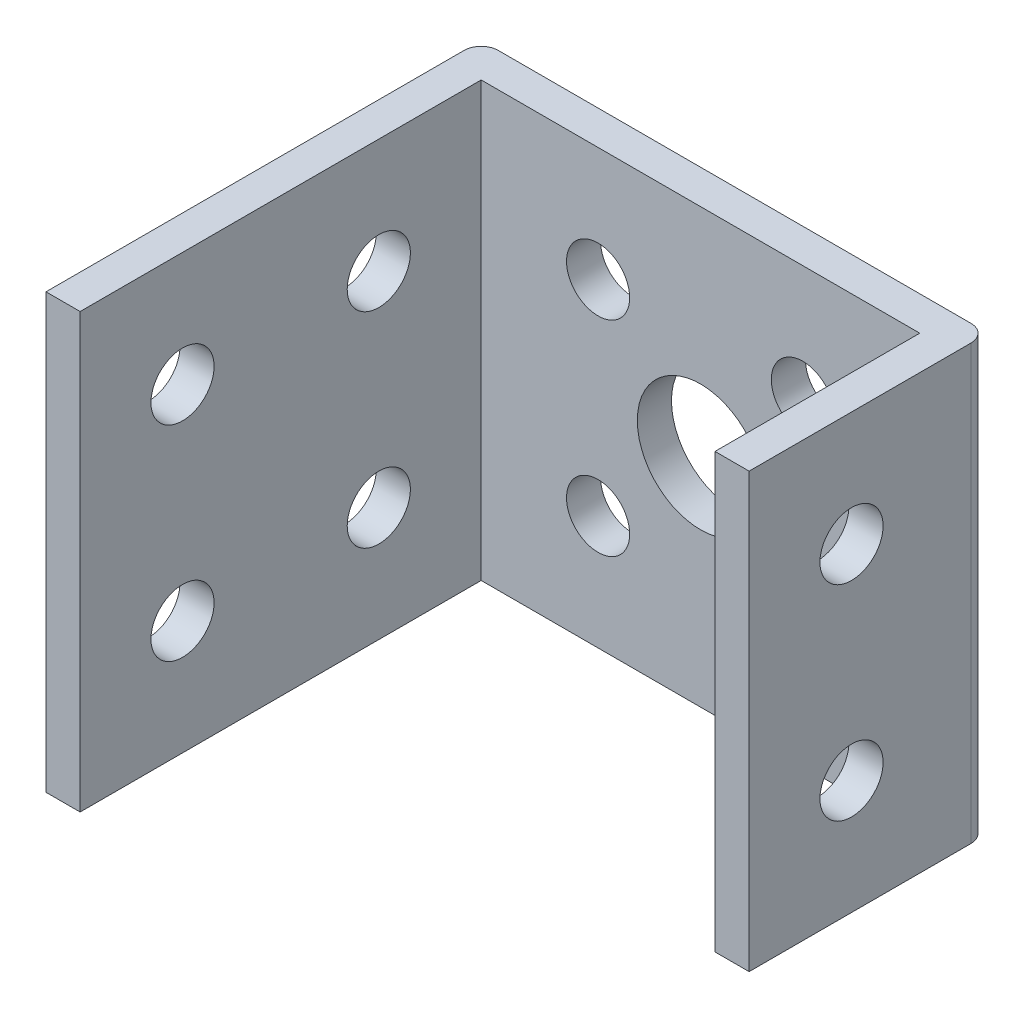
ISO-10303-21;
HEADER;
FILE_DESCRIPTION(('STEP AP214'),'2;1');
FILE_NAME('part.step','',(''),(''),'','','');
FILE_SCHEMA(('AUTOMOTIVE_DESIGN { 1 0 10303 214 1 1 1 1 }'));
ENDSEC;
DATA;
#1=APPLICATION_CONTEXT('core data for automotive mechanical design processes');
#2=APPLICATION_PROTOCOL_DEFINITION('international standard','automotive_design',2000,#1);
#3=PRODUCT_CONTEXT('',#1,'mechanical');
#4=PRODUCT('Part','Part','',(#3));
#5=PRODUCT_RELATED_PRODUCT_CATEGORY('part','',(#4));
#6=PRODUCT_DEFINITION_FORMATION('','',#4);
#7=PRODUCT_DEFINITION_CONTEXT('part definition',#1,'design');
#8=PRODUCT_DEFINITION('design','',#6,#7);
#9=PRODUCT_DEFINITION_SHAPE('','',#8);
#10=(LENGTH_UNIT() NAMED_UNIT(*) SI_UNIT(.MILLI.,.METRE.));
#11=(NAMED_UNIT(*) PLANE_ANGLE_UNIT() SI_UNIT($,.RADIAN.));
#12=(NAMED_UNIT(*) SI_UNIT($,.STERADIAN.) SOLID_ANGLE_UNIT());
#13=UNCERTAINTY_MEASURE_WITH_UNIT(LENGTH_MEASURE(1.E-05),#10,'distance_accuracy_value','');
#14=(GEOMETRIC_REPRESENTATION_CONTEXT(3) GLOBAL_UNCERTAINTY_ASSIGNED_CONTEXT((#13)) GLOBAL_UNIT_ASSIGNED_CONTEXT((#10,
#11,#12)) REPRESENTATION_CONTEXT('',''));
#15=CARTESIAN_POINT('',(0.,0.,0.));
#16=DIRECTION('',(0.,0.,1.));
#17=DIRECTION('',(1.,0.,0.));
#18=AXIS2_PLACEMENT_3D('',#15,#16,#17);
#19=CARTESIAN_POINT('',(-14.85,12.7,14.));
#20=DIRECTION('',(1.,0.,0.));
#21=DIRECTION('',(0.,0.,-1.));
#22=AXIS2_PLACEMENT_3D('',#19,#20,#21);
#23=PLANE('',#22);
#24=CARTESIAN_POINT('',(-14.85,6.,8.));
#25=DIRECTION('',(-1.,0.,0.));
#26=DIRECTION('',(0.,0.,1.));
#27=AXIS2_PLACEMENT_3D('',#24,#25,#26);
#28=CIRCLE('',#27,1.85);
#29=CARTESIAN_POINT('',(-14.85,6.,9.85));
#30=VERTEX_POINT('',#29);
#31=EDGE_CURVE('E179',#30,#30,#28,.T.);
#32=ORIENTED_EDGE('',*,*,#31,.F.);
#33=EDGE_LOOP('',(#32));
#34=FACE_BOUND('',#33,.T.);
#35=CARTESIAN_POINT('',(-14.85,-6.,8.));
#36=DIRECTION('',(-1.,0.,0.));
#37=DIRECTION('',(0.,0.,1.));
#38=AXIS2_PLACEMENT_3D('',#35,#36,#37);
#39=CIRCLE('',#38,1.85);
#40=CARTESIAN_POINT('',(-14.85,-6.,9.85));
#41=VERTEX_POINT('',#40);
#42=EDGE_CURVE('E191',#41,#41,#39,.T.);
#43=ORIENTED_EDGE('',*,*,#42,.F.);
#44=EDGE_LOOP('',(#43));
#45=FACE_BOUND('',#44,.T.);
#46=DIRECTION('',(0.,0.,1.));
#47=VECTOR('',#46,1.);
#48=CARTESIAN_POINT('',(-14.85,12.7,14.));
#49=LINE('',#48,#47);
#50=CARTESIAN_POINT('',(-14.85,12.7,0.999999999999999));
#51=VERTEX_POINT('',#50);
#52=CARTESIAN_POINT('',(-14.85,12.7,25.5));
#53=VERTEX_POINT('',#52);
#54=EDGE_CURVE('E123',#51,#53,#49,.T.);
#55=ORIENTED_EDGE('',*,*,#54,.F.);
#56=DIRECTION('',(0.,-1.,0.));
#57=VECTOR('',#56,1.);
#58=CARTESIAN_POINT('',(-14.85,12.7,0.999999999999999));
#59=LINE('',#58,#57);
#60=CARTESIAN_POINT('',(-14.85,-12.7,0.999999999999999));
#61=VERTEX_POINT('',#60);
#62=EDGE_CURVE('E11',#51,#61,#59,.T.);
#63=ORIENTED_EDGE('',*,*,#62,.T.);
#64=DIRECTION('',(0.,0.,1.));
#65=VECTOR('',#64,1.);
#66=CARTESIAN_POINT('',(-14.85,-12.7,14.));
#67=LINE('',#66,#65);
#68=CARTESIAN_POINT('',(-14.85,-12.7,25.5));
#69=VERTEX_POINT('',#68);
#70=EDGE_CURVE('E203',#61,#69,#67,.T.);
#71=ORIENTED_EDGE('',*,*,#70,.T.);
#72=DIRECTION('',(0.,-1.,0.));
#73=VECTOR('',#72,1.);
#74=CARTESIAN_POINT('',(-14.85,12.7,25.5));
#75=LINE('',#74,#73);
#76=EDGE_CURVE('E131',#53,#69,#75,.T.);
#77=ORIENTED_EDGE('',*,*,#76,.F.);
#78=EDGE_LOOP('',(#55,#63,#71,#77));
#79=FACE_BOUND('',#78,.T.);
#80=CARTESIAN_POINT('',(-14.85,6.,19.5));
#81=DIRECTION('',(1.,0.,0.));
#82=DIRECTION('',(0.,0.,-1.));
#83=AXIS2_PLACEMENT_3D('',#80,#81,#82);
#84=CIRCLE('',#83,1.85);
#85=CARTESIAN_POINT('',(-14.85,6.,17.65));
#86=VERTEX_POINT('',#85);
#87=EDGE_CURVE('E139',#86,#86,#84,.T.);
#88=ORIENTED_EDGE('',*,*,#87,.T.);
#89=EDGE_LOOP('',(#88));
#90=FACE_BOUND('',#89,.T.);
#91=CARTESIAN_POINT('',(-14.85,-6.,19.5));
#92=DIRECTION('',(1.,0.,0.));
#93=DIRECTION('',(0.,0.,-1.));
#94=AXIS2_PLACEMENT_3D('',#91,#92,#93);
#95=CIRCLE('',#94,1.85);
#96=CARTESIAN_POINT('',(-14.85,-6.,17.65));
#97=VERTEX_POINT('',#96);
#98=EDGE_CURVE('E136',#97,#97,#95,.T.);
#99=ORIENTED_EDGE('',*,*,#98,.T.);
#100=EDGE_LOOP('',(#99));
#101=FACE_BOUND('',#100,.T.);
#102=ADVANCED_FACE('F32',(#34,#45,#79,#90,#101),#23,.F.);
#103=CARTESIAN_POINT('',(-12.85,12.7,2.));
#104=DIRECTION('',(-1.,0.,0.));
#105=DIRECTION('',(0.,0.,1.));
#106=AXIS2_PLACEMENT_3D('',#103,#104,#105);
#107=PLANE('',#106);
#108=CARTESIAN_POINT('',(-12.85,6.,8.));
#109=DIRECTION('',(-1.,0.,0.));
#110=DIRECTION('',(0.,0.,1.));
#111=AXIS2_PLACEMENT_3D('',#108,#109,#110);
#112=CIRCLE('',#111,1.85);
#113=CARTESIAN_POINT('',(-12.85,6.,9.85));
#114=VERTEX_POINT('',#113);
#115=EDGE_CURVE('E188',#114,#114,#112,.T.);
#116=ORIENTED_EDGE('',*,*,#115,.T.);
#117=EDGE_LOOP('',(#116));
#118=FACE_BOUND('',#117,.T.);
#119=CARTESIAN_POINT('',(-12.85,-6.,8.));
#120=DIRECTION('',(-1.,0.,0.));
#121=DIRECTION('',(0.,0.,1.));
#122=AXIS2_PLACEMENT_3D('',#119,#120,#121);
#123=CIRCLE('',#122,1.85);
#124=CARTESIAN_POINT('',(-12.85,-6.,9.85));
#125=VERTEX_POINT('',#124);
#126=EDGE_CURVE('E200',#125,#125,#123,.T.);
#127=ORIENTED_EDGE('',*,*,#126,.T.);
#128=EDGE_LOOP('',(#127));
#129=FACE_BOUND('',#128,.T.);
#130=DIRECTION('',(0.,0.,-1.));
#131=VECTOR('',#130,1.);
#132=CARTESIAN_POINT('',(-12.85,-12.7,2.));
#133=LINE('',#132,#131);
#134=CARTESIAN_POINT('',(-12.85,-12.7,25.5));
#135=VERTEX_POINT('',#134);
#136=CARTESIAN_POINT('',(-12.85,-12.7,2.));
#137=VERTEX_POINT('',#136);
#138=EDGE_CURVE('E217',#135,#137,#133,.T.);
#139=ORIENTED_EDGE('',*,*,#138,.T.);
#140=DIRECTION('',(0.,-1.,0.));
#141=VECTOR('',#140,1.);
#142=CARTESIAN_POINT('',(-12.85,12.7,2.));
#143=LINE('',#142,#141);
#144=CARTESIAN_POINT('',(-12.85,12.7,2.));
#145=VERTEX_POINT('',#144);
#146=EDGE_CURVE('E120',#145,#137,#143,.T.);
#147=ORIENTED_EDGE('',*,*,#146,.F.);
#148=DIRECTION('',(0.,0.,-1.));
#149=VECTOR('',#148,1.);
#150=CARTESIAN_POINT('',(-12.85,12.7,2.));
#151=LINE('',#150,#149);
#152=CARTESIAN_POINT('',(-12.85,12.7,25.5));
#153=VERTEX_POINT('',#152);
#154=EDGE_CURVE('E112',#153,#145,#151,.T.);
#155=ORIENTED_EDGE('',*,*,#154,.F.);
#156=DIRECTION('',(0.,1.,0.));
#157=VECTOR('',#156,1.);
#158=CARTESIAN_POINT('',(-12.85,12.7,25.5));
#159=LINE('',#158,#157);
#160=EDGE_CURVE('E117',#135,#153,#159,.T.);
#161=ORIENTED_EDGE('',*,*,#160,.F.);
#162=EDGE_LOOP('',(#139,#147,#155,#161));
#163=FACE_BOUND('',#162,.T.);
#164=CARTESIAN_POINT('',(-12.85,-6.,19.5));
#165=DIRECTION('',(-1.,0.,0.));
#166=DIRECTION('',(0.,0.,1.));
#167=AXIS2_PLACEMENT_3D('',#164,#165,#166);
#168=CIRCLE('',#167,1.85);
#169=CARTESIAN_POINT('',(-12.85,-6.,21.35));
#170=VERTEX_POINT('',#169);
#171=EDGE_CURVE('E147',#170,#170,#168,.T.);
#172=ORIENTED_EDGE('',*,*,#171,.T.);
#173=EDGE_LOOP('',(#172));
#174=FACE_BOUND('',#173,.T.);
#175=CARTESIAN_POINT('',(-12.85,6.,19.5));
#176=DIRECTION('',(-1.,0.,0.));
#177=DIRECTION('',(0.,0.,1.));
#178=AXIS2_PLACEMENT_3D('',#175,#176,#177);
#179=CIRCLE('',#178,1.85);
#180=CARTESIAN_POINT('',(-12.85,6.,21.35));
#181=VERTEX_POINT('',#180);
#182=EDGE_CURVE('E143',#181,#181,#179,.T.);
#183=ORIENTED_EDGE('',*,*,#182,.T.);
#184=EDGE_LOOP('',(#183));
#185=FACE_BOUND('',#184,.T.);
#186=ADVANCED_FACE('F114',(#118,#129,#163,#174,#185),#107,.F.);
#187=CARTESIAN_POINT('',(12.85,12.7,2.00000000000002));
#188=DIRECTION('',(0.,0.,-1.));
#189=DIRECTION('',(-1.,0.,0.));
#190=AXIS2_PLACEMENT_3D('',#187,#188,#189);
#191=PLANE('',#190);
#192=CARTESIAN_POINT('',(6.,6.,2.00000000000001));
#193=DIRECTION('',(0.,0.,1.));
#194=DIRECTION('',(1.,0.,0.));
#195=AXIS2_PLACEMENT_3D('',#192,#193,#194);
#196=CIRCLE('',#195,1.85);
#197=CARTESIAN_POINT('',(7.85,6.,2.00000000000001));
#198=VERTEX_POINT('',#197);
#199=EDGE_CURVE('E146',#198,#198,#196,.T.);
#200=ORIENTED_EDGE('',*,*,#199,.F.);
#201=EDGE_LOOP('',(#200));
#202=FACE_BOUND('',#201,.T.);
#203=CARTESIAN_POINT('',(6.,-6.,2.00000000000001));
#204=DIRECTION('',(0.,0.,1.));
#205=DIRECTION('',(1.,0.,0.));
#206=AXIS2_PLACEMENT_3D('',#203,#204,#205);
#207=CIRCLE('',#206,1.85);
#208=CARTESIAN_POINT('',(7.85,-6.,2.00000000000001));
#209=VERTEX_POINT('',#208);
#210=EDGE_CURVE('E153',#209,#209,#207,.T.);
#211=ORIENTED_EDGE('',*,*,#210,.F.);
#212=EDGE_LOOP('',(#211));
#213=FACE_BOUND('',#212,.T.);
#214=CARTESIAN_POINT('',(-6.,-6.,2.00000000000001));
#215=DIRECTION('',(0.,0.,1.));
#216=DIRECTION('',(1.,0.,0.));
#217=AXIS2_PLACEMENT_3D('',#214,#215,#216);
#218=CIRCLE('',#217,1.85);
#219=CARTESIAN_POINT('',(-4.15,-6.,2.00000000000001));
#220=VERTEX_POINT('',#219);
#221=EDGE_CURVE('E159',#220,#220,#218,.T.);
#222=ORIENTED_EDGE('',*,*,#221,.F.);
#223=EDGE_LOOP('',(#222));
#224=FACE_BOUND('',#223,.T.);
#225=CARTESIAN_POINT('',(-6.,6.,2.00000000000001));
#226=DIRECTION('',(0.,0.,1.));
#227=DIRECTION('',(1.,0.,0.));
#228=AXIS2_PLACEMENT_3D('',#225,#226,#227);
#229=CIRCLE('',#228,1.85);
#230=CARTESIAN_POINT('',(-4.15,6.,2.00000000000001));
#231=VERTEX_POINT('',#230);
#232=EDGE_CURVE('E165',#231,#231,#229,.T.);
#233=ORIENTED_EDGE('',*,*,#232,.F.);
#234=EDGE_LOOP('',(#233));
#235=FACE_BOUND('',#234,.T.);
#236=CARTESIAN_POINT('',(0.,0.,2.00000000000001));
#237=DIRECTION('',(0.,0.,-1.));
#238=DIRECTION('',(-1.,0.,0.));
#239=AXIS2_PLACEMENT_3D('',#236,#237,#238);
#240=CIRCLE('',#239,3.7);
#241=CARTESIAN_POINT('',(-3.7,0.,2.00000000000001));
#242=VERTEX_POINT('',#241);
#243=EDGE_CURVE('E176',#242,#242,#240,.T.);
#244=ORIENTED_EDGE('',*,*,#243,.T.);
#245=EDGE_LOOP('',(#244));
#246=FACE_BOUND('',#245,.T.);
#247=DIRECTION('',(1.,0.,0.));
#248=VECTOR('',#247,1.);
#249=CARTESIAN_POINT('',(12.85,-12.7,2.00000000000002));
#250=LINE('',#249,#248);
#251=CARTESIAN_POINT('',(12.85,-12.7,2.00000000000002));
#252=VERTEX_POINT('',#251);
#253=EDGE_CURVE('E219',#137,#252,#250,.T.);
#254=ORIENTED_EDGE('',*,*,#253,.T.);
#255=DIRECTION('',(0.,-1.,0.));
#256=VECTOR('',#255,1.);
#257=CARTESIAN_POINT('',(12.85,12.7,2.00000000000002));
#258=LINE('',#257,#256);
#259=CARTESIAN_POINT('',(12.85,12.7,2.00000000000002));
#260=VERTEX_POINT('',#259);
#261=EDGE_CURVE('E234',#260,#252,#258,.T.);
#262=ORIENTED_EDGE('',*,*,#261,.F.);
#263=DIRECTION('',(1.,0.,0.));
#264=VECTOR('',#263,1.);
#265=CARTESIAN_POINT('',(12.85,12.7,2.00000000000002));
#266=LINE('',#265,#264);
#267=EDGE_CURVE('E122',#145,#260,#266,.T.);
#268=ORIENTED_EDGE('',*,*,#267,.F.);
#269=ORIENTED_EDGE('',*,*,#146,.T.);
#270=EDGE_LOOP('',(#254,#262,#268,#269));
#271=FACE_BOUND('',#270,.T.);
#272=ADVANCED_FACE('F274',(#202,#213,#224,#235,#246,#271),#191,.F.);
#273=CARTESIAN_POINT('',(12.85,12.7,14.));
#274=DIRECTION('',(1.,0.,0.));
#275=DIRECTION('',(0.,0.,-1.));
#276=AXIS2_PLACEMENT_3D('',#273,#274,#275);
#277=PLANE('',#276);
#278=CARTESIAN_POINT('',(12.85,6.,8.));
#279=DIRECTION('',(1.,0.,0.));
#280=DIRECTION('',(0.,0.,-1.));
#281=AXIS2_PLACEMENT_3D('',#278,#279,#280);
#282=CIRCLE('',#281,1.85);
#283=CARTESIAN_POINT('',(12.85,6.,6.15));
#284=VERTEX_POINT('',#283);
#285=EDGE_CURVE('E183',#284,#284,#282,.T.);
#286=ORIENTED_EDGE('',*,*,#285,.T.);
#287=EDGE_LOOP('',(#286));
#288=FACE_BOUND('',#287,.T.);
#289=CARTESIAN_POINT('',(12.85,-6.,8.));
#290=DIRECTION('',(1.,0.,0.));
#291=DIRECTION('',(0.,0.,-1.));
#292=AXIS2_PLACEMENT_3D('',#289,#290,#291);
#293=CIRCLE('',#292,1.85);
#294=CARTESIAN_POINT('',(12.85,-6.,6.15));
#295=VERTEX_POINT('',#294);
#296=EDGE_CURVE('E195',#295,#295,#293,.T.);
#297=ORIENTED_EDGE('',*,*,#296,.T.);
#298=EDGE_LOOP('',(#297));
#299=FACE_BOUND('',#298,.T.);
#300=DIRECTION('',(0.,0.,1.));
#301=VECTOR('',#300,1.);
#302=CARTESIAN_POINT('',(12.85,-12.7,14.));
#303=LINE('',#302,#301);
#304=CARTESIAN_POINT('',(12.85,-12.7,14.));
#305=VERTEX_POINT('',#304);
#306=EDGE_CURVE('E221',#252,#305,#303,.T.);
#307=ORIENTED_EDGE('',*,*,#306,.T.);
#308=DIRECTION('',(0.,-1.,0.));
#309=VECTOR('',#308,1.);
#310=CARTESIAN_POINT('',(12.85,12.7,14.));
#311=LINE('',#310,#309);
#312=CARTESIAN_POINT('',(12.85,12.7,14.));
#313=VERTEX_POINT('',#312);
#314=EDGE_CURVE('E231',#313,#305,#311,.T.);
#315=ORIENTED_EDGE('',*,*,#314,.F.);
#316=DIRECTION('',(0.,0.,1.));
#317=VECTOR('',#316,1.);
#318=CARTESIAN_POINT('',(12.85,12.7,14.));
#319=LINE('',#318,#317);
#320=EDGE_CURVE('E207',#260,#313,#319,.T.);
#321=ORIENTED_EDGE('',*,*,#320,.F.);
#322=ORIENTED_EDGE('',*,*,#261,.T.);
#323=EDGE_LOOP('',(#307,#315,#321,#322));
#324=FACE_BOUND('',#323,.T.);
#325=ADVANCED_FACE('F270',(#288,#299,#324),#277,.F.);
#326=CARTESIAN_POINT('',(14.85,12.7,14.));
#327=DIRECTION('',(0.,0.,-1.));
#328=DIRECTION('',(-1.,0.,0.));
#329=AXIS2_PLACEMENT_3D('',#326,#327,#328);
#330=PLANE('',#329);
#331=DIRECTION('',(1.,0.,0.));
#332=VECTOR('',#331,1.);
#333=CARTESIAN_POINT('',(14.85,-12.7,14.));
#334=LINE('',#333,#332);
#335=CARTESIAN_POINT('',(14.85,-12.7,14.));
#336=VERTEX_POINT('',#335);
#337=EDGE_CURVE('E223',#305,#336,#334,.T.);
#338=ORIENTED_EDGE('',*,*,#337,.T.);
#339=DIRECTION('',(0.,-1.,0.));
#340=VECTOR('',#339,1.);
#341=CARTESIAN_POINT('',(14.85,12.7,14.));
#342=LINE('',#341,#340);
#343=CARTESIAN_POINT('',(14.85,12.7,14.));
#344=VERTEX_POINT('',#343);
#345=EDGE_CURVE('E215',#344,#336,#342,.T.);
#346=ORIENTED_EDGE('',*,*,#345,.F.);
#347=DIRECTION('',(1.,0.,0.));
#348=VECTOR('',#347,1.);
#349=CARTESIAN_POINT('',(14.85,12.7,14.));
#350=LINE('',#349,#348);
#351=EDGE_CURVE('E209',#313,#344,#350,.T.);
#352=ORIENTED_EDGE('',*,*,#351,.F.);
#353=ORIENTED_EDGE('',*,*,#314,.T.);
#354=EDGE_LOOP('',(#338,#346,#352,#353));
#355=FACE_BOUND('',#354,.T.);
#356=ADVANCED_FACE('F265',(#355),#330,.F.);
#357=CARTESIAN_POINT('',(14.85,12.7,0.));
#358=DIRECTION('',(-1.,0.,0.));
#359=DIRECTION('',(0.,0.,1.));
#360=AXIS2_PLACEMENT_3D('',#357,#358,#359);
#361=PLANE('',#360);
#362=CARTESIAN_POINT('',(14.85,6.,8.));
#363=DIRECTION('',(-1.,0.,0.));
#364=DIRECTION('',(0.,0.,1.));
#365=AXIS2_PLACEMENT_3D('',#362,#363,#364);
#366=CIRCLE('',#365,1.85);
#367=CARTESIAN_POINT('',(14.85,6.,9.85));
#368=VERTEX_POINT('',#367);
#369=EDGE_CURVE('E180',#368,#368,#366,.T.);
#370=ORIENTED_EDGE('',*,*,#369,.T.);
#371=EDGE_LOOP('',(#370));
#372=FACE_BOUND('',#371,.T.);
#373=CARTESIAN_POINT('',(14.85,-6.,8.));
#374=DIRECTION('',(-1.,0.,0.));
#375=DIRECTION('',(0.,0.,1.));
#376=AXIS2_PLACEMENT_3D('',#373,#374,#375);
#377=CIRCLE('',#376,1.85);
#378=CARTESIAN_POINT('',(14.85,-6.,9.85));
#379=VERTEX_POINT('',#378);
#380=EDGE_CURVE('E192',#379,#379,#377,.T.);
#381=ORIENTED_EDGE('',*,*,#380,.T.);
#382=EDGE_LOOP('',(#381));
#383=FACE_BOUND('',#382,.T.);
#384=DIRECTION('',(0.,0.,-1.));
#385=VECTOR('',#384,1.);
#386=CARTESIAN_POINT('',(14.85,-12.7,0.));
#387=LINE('',#386,#385);
#388=CARTESIAN_POINT('',(14.85,-12.7,1.));
#389=VERTEX_POINT('',#388);
#390=EDGE_CURVE('E225',#336,#389,#387,.T.);
#391=ORIENTED_EDGE('',*,*,#390,.T.);
#392=DIRECTION('',(0.,-1.,0.));
#393=VECTOR('',#392,1.);
#394=CARTESIAN_POINT('',(14.85,12.7,1.));
#395=LINE('',#394,#393);
#396=CARTESIAN_POINT('',(14.85,12.7,1.));
#397=VERTEX_POINT('',#396);
#398=EDGE_CURVE('E55',#389,#397,#395,.F.);
#399=ORIENTED_EDGE('',*,*,#398,.T.);
#400=DIRECTION('',(0.,0.,-1.));
#401=VECTOR('',#400,1.);
#402=CARTESIAN_POINT('',(14.85,12.7,0.));
#403=LINE('',#402,#401);
#404=EDGE_CURVE('E211',#344,#397,#403,.T.);
#405=ORIENTED_EDGE('',*,*,#404,.F.);
#406=ORIENTED_EDGE('',*,*,#345,.T.);
#407=EDGE_LOOP('',(#391,#399,#405,#406));
#408=FACE_BOUND('',#407,.T.);
#409=ADVANCED_FACE('F261',(#372,#383,#408),#361,.F.);
#410=CARTESIAN_POINT('',(-14.85,12.7,0.));
#411=DIRECTION('',(0.,0.,1.));
#412=DIRECTION('',(1.,0.,0.));
#413=AXIS2_PLACEMENT_3D('',#410,#411,#412);
#414=PLANE('',#413);
#415=CARTESIAN_POINT('',(6.,6.,0.));
#416=DIRECTION('',(0.,0.,1.));
#417=DIRECTION('',(1.,0.,0.));
#418=AXIS2_PLACEMENT_3D('',#415,#416,#417);
#419=CIRCLE('',#418,1.85);
#420=CARTESIAN_POINT('',(7.85,6.,0.));
#421=VERTEX_POINT('',#420);
#422=EDGE_CURVE('E150',#421,#421,#419,.T.);
#423=ORIENTED_EDGE('',*,*,#422,.T.);
#424=EDGE_LOOP('',(#423));
#425=FACE_BOUND('',#424,.T.);
#426=CARTESIAN_POINT('',(6.,-6.,0.));
#427=DIRECTION('',(0.,0.,1.));
#428=DIRECTION('',(1.,0.,0.));
#429=AXIS2_PLACEMENT_3D('',#426,#427,#428);
#430=CIRCLE('',#429,1.85);
#431=CARTESIAN_POINT('',(7.85,-6.,0.));
#432=VERTEX_POINT('',#431);
#433=EDGE_CURVE('E156',#432,#432,#430,.T.);
#434=ORIENTED_EDGE('',*,*,#433,.T.);
#435=EDGE_LOOP('',(#434));
#436=FACE_BOUND('',#435,.T.);
#437=CARTESIAN_POINT('',(-6.,-6.,0.));
#438=DIRECTION('',(0.,0.,1.));
#439=DIRECTION('',(1.,0.,0.));
#440=AXIS2_PLACEMENT_3D('',#437,#438,#439);
#441=CIRCLE('',#440,1.85);
#442=CARTESIAN_POINT('',(-4.15,-6.,0.));
#443=VERTEX_POINT('',#442);
#444=EDGE_CURVE('E162',#443,#443,#441,.T.);
#445=ORIENTED_EDGE('',*,*,#444,.T.);
#446=EDGE_LOOP('',(#445));
#447=FACE_BOUND('',#446,.T.);
#448=CARTESIAN_POINT('',(-6.,6.,0.));
#449=DIRECTION('',(0.,0.,1.));
#450=DIRECTION('',(1.,0.,0.));
#451=AXIS2_PLACEMENT_3D('',#448,#449,#450);
#452=CIRCLE('',#451,1.85);
#453=CARTESIAN_POINT('',(-4.15,6.,0.));
#454=VERTEX_POINT('',#453);
#455=EDGE_CURVE('E168',#454,#454,#452,.T.);
#456=ORIENTED_EDGE('',*,*,#455,.T.);
#457=EDGE_LOOP('',(#456));
#458=FACE_BOUND('',#457,.T.);
#459=CARTESIAN_POINT('',(0.,0.,0.));
#460=DIRECTION('',(0.,0.,-1.));
#461=DIRECTION('',(-1.,0.,0.));
#462=AXIS2_PLACEMENT_3D('',#459,#460,#461);
#463=CIRCLE('',#462,3.7);
#464=CARTESIAN_POINT('',(-3.7,0.,0.));
#465=VERTEX_POINT('',#464);
#466=EDGE_CURVE('E171',#465,#465,#463,.T.);
#467=ORIENTED_EDGE('',*,*,#466,.F.);
#468=EDGE_LOOP('',(#467));
#469=FACE_BOUND('',#468,.T.);
#470=DIRECTION('',(-1.,0.,0.));
#471=VECTOR('',#470,1.);
#472=CARTESIAN_POINT('',(-14.85,12.7,0.));
#473=LINE('',#472,#471);
#474=CARTESIAN_POINT('',(13.85,12.7,0.));
#475=VERTEX_POINT('',#474);
#476=CARTESIAN_POINT('',(-13.85,12.7,0.));
#477=VERTEX_POINT('',#476);
#478=EDGE_CURVE('E213',#475,#477,#473,.T.);
#479=ORIENTED_EDGE('',*,*,#478,.F.);
#480=DIRECTION('',(0.,-1.,0.));
#481=VECTOR('',#480,1.);
#482=CARTESIAN_POINT('',(13.85,12.7,0.));
#483=LINE('',#482,#481);
#484=CARTESIAN_POINT('',(13.85,-12.7,0.));
#485=VERTEX_POINT('',#484);
#486=EDGE_CURVE('E240',#475,#485,#483,.T.);
#487=ORIENTED_EDGE('',*,*,#486,.T.);
#488=DIRECTION('',(-1.,0.,0.));
#489=VECTOR('',#488,1.);
#490=CARTESIAN_POINT('',(-14.85,-12.7,0.));
#491=LINE('',#490,#489);
#492=CARTESIAN_POINT('',(-13.85,-12.7,0.));
#493=VERTEX_POINT('',#492);
#494=EDGE_CURVE('E204',#485,#493,#491,.T.);
#495=ORIENTED_EDGE('',*,*,#494,.T.);
#496=DIRECTION('',(0.,-1.,0.));
#497=VECTOR('',#496,1.);
#498=CARTESIAN_POINT('',(-13.85,12.7,0.));
#499=LINE('',#498,#497);
#500=EDGE_CURVE('E238',#493,#477,#499,.F.);
#501=ORIENTED_EDGE('',*,*,#500,.T.);
#502=EDGE_LOOP('',(#479,#487,#495,#501));
#503=FACE_BOUND('',#502,.T.);
#504=ADVANCED_FACE('F253',(#425,#436,#447,#458,#469,#503),#414,.F.);
#505=CARTESIAN_POINT('',(0.,12.7,0.));
#506=DIRECTION('',(0.,-1.,0.));
#507=DIRECTION('',(0.,0.,-1.));
#508=AXIS2_PLACEMENT_3D('',#505,#506,#507);
#509=PLANE('',#508);
#510=ORIENTED_EDGE('',*,*,#404,.T.);
#511=CARTESIAN_POINT('',(13.85,12.7,1.));
#512=DIRECTION('',(0.,-1.,0.));
#513=DIRECTION('',(0.,0.,-1.));
#514=AXIS2_PLACEMENT_3D('',#511,#512,#513);
#515=CIRCLE('',#514,1.);
#516=EDGE_CURVE('E40',#397,#475,#515,.F.);
#517=ORIENTED_EDGE('',*,*,#516,.T.);
#518=ORIENTED_EDGE('',*,*,#478,.T.);
#519=CARTESIAN_POINT('',(-13.85,12.7,0.999999999999999));
#520=DIRECTION('',(0.,-1.,0.));
#521=DIRECTION('',(0.,0.,-1.));
#522=AXIS2_PLACEMENT_3D('',#519,#520,#521);
#523=CIRCLE('',#522,1.);
#524=EDGE_CURVE('E47',#477,#51,#523,.F.);
#525=ORIENTED_EDGE('',*,*,#524,.T.);
#526=ORIENTED_EDGE('',*,*,#54,.T.);
#527=DIRECTION('',(-1.,0.,0.));
#528=VECTOR('',#527,1.);
#529=CARTESIAN_POINT('',(15.0320730936564,12.7,25.5));
#530=LINE('',#529,#528);
#531=EDGE_CURVE('E126',#153,#53,#530,.T.);
#532=ORIENTED_EDGE('',*,*,#531,.F.);
#533=ORIENTED_EDGE('',*,*,#154,.T.);
#534=ORIENTED_EDGE('',*,*,#267,.T.);
#535=ORIENTED_EDGE('',*,*,#320,.T.);
#536=ORIENTED_EDGE('',*,*,#351,.T.);
#537=EDGE_LOOP('',(#510,#517,#518,#525,#526,#532,#533,#534,#535,#536));
#538=FACE_BOUND('',#537,.T.);
#539=ADVANCED_FACE('F127',(#538),#509,.F.);
#540=CARTESIAN_POINT('',(0.,-12.7,0.));
#541=DIRECTION('',(0.,-1.,0.));
#542=DIRECTION('',(0.,0.,-1.));
#543=AXIS2_PLACEMENT_3D('',#540,#541,#542);
#544=PLANE('',#543);
#545=ORIENTED_EDGE('',*,*,#494,.F.);
#546=CARTESIAN_POINT('',(13.85,-12.7,1.));
#547=DIRECTION('',(0.,-1.,0.));
#548=DIRECTION('',(0.,0.,-1.));
#549=AXIS2_PLACEMENT_3D('',#546,#547,#548);
#550=CIRCLE('',#549,1.);
#551=EDGE_CURVE('E245',#485,#389,#550,.T.);
#552=ORIENTED_EDGE('',*,*,#551,.T.);
#553=ORIENTED_EDGE('',*,*,#390,.F.);
#554=ORIENTED_EDGE('',*,*,#337,.F.);
#555=ORIENTED_EDGE('',*,*,#306,.F.);
#556=ORIENTED_EDGE('',*,*,#253,.F.);
#557=ORIENTED_EDGE('',*,*,#138,.F.);
#558=DIRECTION('',(-1.,0.,0.));
#559=VECTOR('',#558,1.);
#560=CARTESIAN_POINT('',(15.0320730936564,-12.7,25.5));
#561=LINE('',#560,#559);
#562=EDGE_CURVE('E135',#135,#69,#561,.T.);
#563=ORIENTED_EDGE('',*,*,#562,.T.);
#564=ORIENTED_EDGE('',*,*,#70,.F.);
#565=CARTESIAN_POINT('',(-13.85,-12.7,0.999999999999999));
#566=DIRECTION('',(0.,-1.,0.));
#567=DIRECTION('',(0.,0.,-1.));
#568=AXIS2_PLACEMENT_3D('',#565,#566,#567);
#569=CIRCLE('',#568,1.);
#570=EDGE_CURVE('E243',#61,#493,#569,.T.);
#571=ORIENTED_EDGE('',*,*,#570,.T.);
#572=EDGE_LOOP('',(#545,#552,#553,#554,#555,#556,#557,#563,#564,#571));
#573=FACE_BOUND('',#572,.T.);
#574=ADVANCED_FACE('F259',(#573),#544,.T.);
#575=CARTESIAN_POINT('',(14.85,-6.,8.));
#576=DIRECTION('',(-1.,0.,0.));
#577=DIRECTION('',(0.,0.,1.));
#578=AXIS2_PLACEMENT_3D('',#575,#576,#577);
#579=CYLINDRICAL_SURFACE('',#578,1.85);
#580=ORIENTED_EDGE('',*,*,#380,.F.);
#581=EDGE_LOOP('',(#580));
#582=FACE_BOUND('',#581,.T.);
#583=ORIENTED_EDGE('',*,*,#296,.F.);
#584=EDGE_LOOP('',(#583));
#585=FACE_BOUND('',#584,.T.);
#586=ADVANCED_FACE('F342',(#582,#585),#579,.F.);
#587=ORIENTED_EDGE('',*,*,#42,.T.);
#588=EDGE_LOOP('',(#587));
#589=FACE_BOUND('',#588,.T.);
#590=ORIENTED_EDGE('',*,*,#126,.F.);
#591=EDGE_LOOP('',(#590));
#592=FACE_BOUND('',#591,.T.);
#593=ADVANCED_FACE('F339',(#589,#592),#579,.F.);
#594=CARTESIAN_POINT('',(14.85,6.,8.));
#595=DIRECTION('',(-1.,0.,0.));
#596=DIRECTION('',(0.,0.,1.));
#597=AXIS2_PLACEMENT_3D('',#594,#595,#596);
#598=CYLINDRICAL_SURFACE('',#597,1.85);
#599=ORIENTED_EDGE('',*,*,#369,.F.);
#600=EDGE_LOOP('',(#599));
#601=FACE_BOUND('',#600,.T.);
#602=ORIENTED_EDGE('',*,*,#285,.F.);
#603=EDGE_LOOP('',(#602));
#604=FACE_BOUND('',#603,.T.);
#605=ADVANCED_FACE('F337',(#601,#604),#598,.F.);
#606=ORIENTED_EDGE('',*,*,#31,.T.);
#607=EDGE_LOOP('',(#606));
#608=FACE_BOUND('',#607,.T.);
#609=ORIENTED_EDGE('',*,*,#115,.F.);
#610=EDGE_LOOP('',(#609));
#611=FACE_BOUND('',#610,.T.);
#612=ADVANCED_FACE('F333',(#608,#611),#598,.F.);
#613=CARTESIAN_POINT('',(0.,0.,14.));
#614=DIRECTION('',(0.,0.,-1.));
#615=DIRECTION('',(-1.,0.,0.));
#616=AXIS2_PLACEMENT_3D('',#613,#614,#615);
#617=CYLINDRICAL_SURFACE('',#616,3.7);
#618=ORIENTED_EDGE('',*,*,#466,.T.);
#619=EDGE_LOOP('',(#618));
#620=FACE_BOUND('',#619,.T.);
#621=ORIENTED_EDGE('',*,*,#243,.F.);
#622=EDGE_LOOP('',(#621));
#623=FACE_BOUND('',#622,.T.);
#624=ADVANCED_FACE('F329',(#620,#623),#617,.F.);
#625=CARTESIAN_POINT('',(-6.,6.,0.));
#626=DIRECTION('',(0.,0.,1.));
#627=DIRECTION('',(1.,0.,0.));
#628=AXIS2_PLACEMENT_3D('',#625,#626,#627);
#629=CYLINDRICAL_SURFACE('',#628,1.85);
#630=ORIENTED_EDGE('',*,*,#455,.F.);
#631=EDGE_LOOP('',(#630));
#632=FACE_BOUND('',#631,.T.);
#633=ORIENTED_EDGE('',*,*,#232,.T.);
#634=EDGE_LOOP('',(#633));
#635=FACE_BOUND('',#634,.T.);
#636=ADVANCED_FACE('F325',(#632,#635),#629,.F.);
#637=CARTESIAN_POINT('',(-6.,-6.,0.));
#638=DIRECTION('',(0.,0.,1.));
#639=DIRECTION('',(1.,0.,0.));
#640=AXIS2_PLACEMENT_3D('',#637,#638,#639);
#641=CYLINDRICAL_SURFACE('',#640,1.85);
#642=ORIENTED_EDGE('',*,*,#444,.F.);
#643=EDGE_LOOP('',(#642));
#644=FACE_BOUND('',#643,.T.);
#645=ORIENTED_EDGE('',*,*,#221,.T.);
#646=EDGE_LOOP('',(#645));
#647=FACE_BOUND('',#646,.T.);
#648=ADVANCED_FACE('F321',(#644,#647),#641,.F.);
#649=CARTESIAN_POINT('',(6.,-6.,0.));
#650=DIRECTION('',(0.,0.,1.));
#651=DIRECTION('',(1.,0.,0.));
#652=AXIS2_PLACEMENT_3D('',#649,#650,#651);
#653=CYLINDRICAL_SURFACE('',#652,1.85);
#654=ORIENTED_EDGE('',*,*,#433,.F.);
#655=EDGE_LOOP('',(#654));
#656=FACE_BOUND('',#655,.T.);
#657=ORIENTED_EDGE('',*,*,#210,.T.);
#658=EDGE_LOOP('',(#657));
#659=FACE_BOUND('',#658,.T.);
#660=ADVANCED_FACE('F317',(#656,#659),#653,.F.);
#661=CARTESIAN_POINT('',(6.,6.,0.));
#662=DIRECTION('',(0.,0.,1.));
#663=DIRECTION('',(1.,0.,0.));
#664=AXIS2_PLACEMENT_3D('',#661,#662,#663);
#665=CYLINDRICAL_SURFACE('',#664,1.85);
#666=ORIENTED_EDGE('',*,*,#422,.F.);
#667=EDGE_LOOP('',(#666));
#668=FACE_BOUND('',#667,.T.);
#669=ORIENTED_EDGE('',*,*,#199,.T.);
#670=EDGE_LOOP('',(#669));
#671=FACE_BOUND('',#670,.T.);
#672=ADVANCED_FACE('F314',(#668,#671),#665,.F.);
#673=CARTESIAN_POINT('',(15.0320730936564,12.7,25.5));
#674=DIRECTION('',(0.,0.,-1.));
#675=DIRECTION('',(0.,1.,0.));
#676=AXIS2_PLACEMENT_3D('',#673,#674,#675);
#677=PLANE('',#676);
#678=ORIENTED_EDGE('',*,*,#562,.F.);
#679=ORIENTED_EDGE('',*,*,#160,.T.);
#680=ORIENTED_EDGE('',*,*,#531,.T.);
#681=ORIENTED_EDGE('',*,*,#76,.T.);
#682=EDGE_LOOP('',(#678,#679,#680,#681));
#683=FACE_BOUND('',#682,.T.);
#684=ADVANCED_FACE('F133',(#683),#677,.F.);
#685=CARTESIAN_POINT('',(15.0320730936564,6.,19.5));
#686=DIRECTION('',(-1.,0.,0.));
#687=DIRECTION('',(0.,0.,1.));
#688=AXIS2_PLACEMENT_3D('',#685,#686,#687);
#689=CYLINDRICAL_SURFACE('',#688,1.85);
#690=ORIENTED_EDGE('',*,*,#182,.F.);
#691=EDGE_LOOP('',(#690));
#692=FACE_BOUND('',#691,.T.);
#693=ORIENTED_EDGE('',*,*,#87,.F.);
#694=EDGE_LOOP('',(#693));
#695=FACE_BOUND('',#694,.T.);
#696=ADVANCED_FACE('F302',(#692,#695),#689,.F.);
#697=CARTESIAN_POINT('',(15.0320730936564,-6.,19.5));
#698=DIRECTION('',(-1.,0.,0.));
#699=DIRECTION('',(0.,0.,1.));
#700=AXIS2_PLACEMENT_3D('',#697,#698,#699);
#701=CYLINDRICAL_SURFACE('',#700,1.85);
#702=ORIENTED_EDGE('',*,*,#171,.F.);
#703=EDGE_LOOP('',(#702));
#704=FACE_BOUND('',#703,.T.);
#705=ORIENTED_EDGE('',*,*,#98,.F.);
#706=EDGE_LOOP('',(#705));
#707=FACE_BOUND('',#706,.T.);
#708=ADVANCED_FACE('F296',(#704,#707),#701,.F.);
#709=CARTESIAN_POINT('',(13.85,12.7,1.));
#710=DIRECTION('',(0.,-1.,0.));
#711=DIRECTION('',(0.,0.,-1.));
#712=AXIS2_PLACEMENT_3D('',#709,#710,#711);
#713=CYLINDRICAL_SURFACE('',#712,1.);
#714=ORIENTED_EDGE('',*,*,#516,.F.);
#715=ORIENTED_EDGE('',*,*,#398,.F.);
#716=ORIENTED_EDGE('',*,*,#551,.F.);
#717=ORIENTED_EDGE('',*,*,#486,.F.);
#718=EDGE_LOOP('',(#714,#715,#716,#717));
#719=FACE_BOUND('',#718,.T.);
#720=ADVANCED_FACE('F256',(#719),#713,.T.);
#721=CARTESIAN_POINT('',(-13.85,12.7,0.999999999999999));
#722=DIRECTION('',(0.,-1.,0.));
#723=DIRECTION('',(0.,0.,-1.));
#724=AXIS2_PLACEMENT_3D('',#721,#722,#723);
#725=CYLINDRICAL_SURFACE('',#724,1.);
#726=ORIENTED_EDGE('',*,*,#524,.F.);
#727=ORIENTED_EDGE('',*,*,#500,.F.);
#728=ORIENTED_EDGE('',*,*,#570,.F.);
#729=ORIENTED_EDGE('',*,*,#62,.F.);
#730=EDGE_LOOP('',(#726,#727,#728,#729));
#731=FACE_BOUND('',#730,.T.);
#732=ADVANCED_FACE('F34',(#731),#725,.T.);
#733=CLOSED_SHELL('',(#102,#186,#272,#325,#356,#409,#504,#539,#574,#586,#593,#605,#612,#624,
#636,#648,#660,#672,#684,#696,#708,#720,#732));
#734=MANIFOLD_SOLID_BREP('B2',#733);
#735=ADVANCED_BREP_SHAPE_REPRESENTATION('',(#18,#734),#14);
#736=SHAPE_DEFINITION_REPRESENTATION(#9,#735);
ENDSEC;
END-ISO-10303-21;
